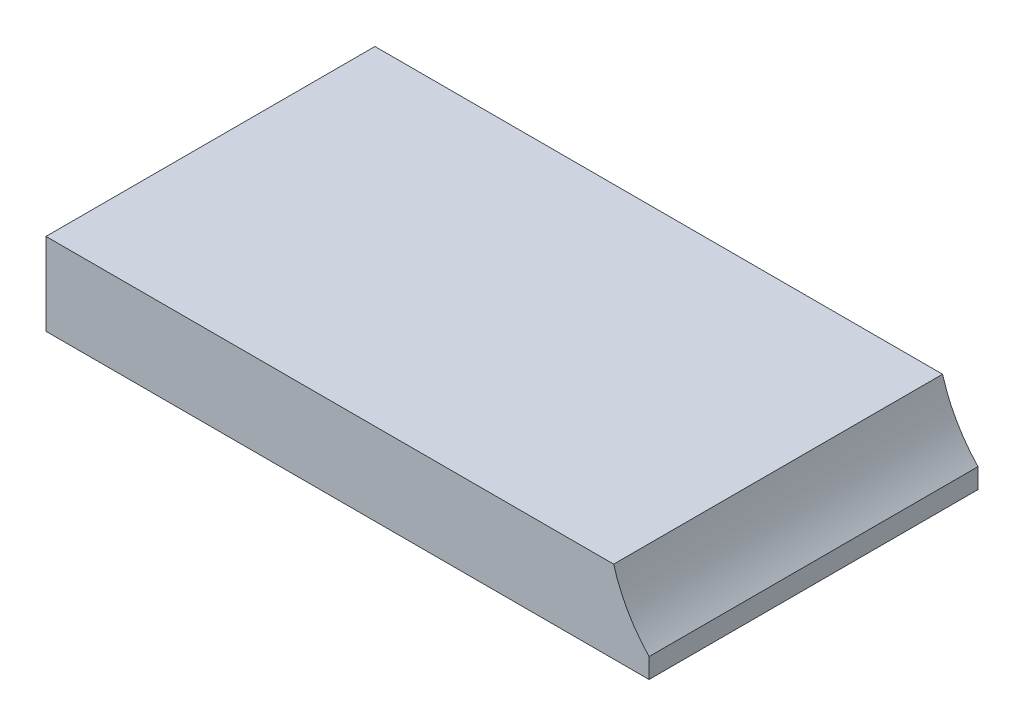
ISO-10303-21;
HEADER;
FILE_DESCRIPTION(('STEP AP214'),'2;1');
FILE_NAME('part.step','',(''),(''),'','','');
FILE_SCHEMA(('AUTOMOTIVE_DESIGN { 1 0 10303 214 1 1 1 1 }'));
ENDSEC;
DATA;
#1=APPLICATION_CONTEXT('core data for automotive mechanical design processes');
#2=APPLICATION_PROTOCOL_DEFINITION('international standard','automotive_design',2000,#1);
#3=PRODUCT_CONTEXT('',#1,'mechanical');
#4=PRODUCT('Part','Part','',(#3));
#5=PRODUCT_RELATED_PRODUCT_CATEGORY('part','',(#4));
#6=PRODUCT_DEFINITION_FORMATION('','',#4);
#7=PRODUCT_DEFINITION_CONTEXT('part definition',#1,'design');
#8=PRODUCT_DEFINITION('design','',#6,#7);
#9=PRODUCT_DEFINITION_SHAPE('','',#8);
#10=(LENGTH_UNIT() NAMED_UNIT(*) SI_UNIT(.MILLI.,.METRE.));
#11=(NAMED_UNIT(*) PLANE_ANGLE_UNIT() SI_UNIT($,.RADIAN.));
#12=(NAMED_UNIT(*) SI_UNIT($,.STERADIAN.) SOLID_ANGLE_UNIT());
#13=UNCERTAINTY_MEASURE_WITH_UNIT(LENGTH_MEASURE(1.E-05),#10,'distance_accuracy_value','');
#14=(GEOMETRIC_REPRESENTATION_CONTEXT(3) GLOBAL_UNCERTAINTY_ASSIGNED_CONTEXT((#13)) GLOBAL_UNIT_ASSIGNED_CONTEXT((#10,
#11,#12)) REPRESENTATION_CONTEXT('',''));
#15=CARTESIAN_POINT('',(0.,0.,0.));
#16=DIRECTION('',(0.,0.,1.));
#17=DIRECTION('',(1.,0.,0.));
#18=AXIS2_PLACEMENT_3D('',#15,#16,#17);
#19=CARTESIAN_POINT('',(0.,3.,0.));
#20=DIRECTION('',(1.,0.,0.));
#21=DIRECTION('',(0.,0.,-1.));
#22=AXIS2_PLACEMENT_3D('',#19,#20,#21);
#23=PLANE('',#22);
#24=DIRECTION('',(0.,0.,1.));
#25=VECTOR('',#24,1.);
#26=CARTESIAN_POINT('',(0.,0.,0.));
#27=LINE('',#26,#25);
#28=CARTESIAN_POINT('',(0.,0.,-12.));
#29=VERTEX_POINT('',#28);
#30=CARTESIAN_POINT('',(0.,0.,0.));
#31=VERTEX_POINT('',#30);
#32=EDGE_CURVE('E88',#29,#31,#27,.T.);
#33=ORIENTED_EDGE('',*,*,#32,.T.);
#34=DIRECTION('',(0.,-1.,0.));
#35=VECTOR('',#34,1.);
#36=CARTESIAN_POINT('',(0.,3.,0.));
#37=LINE('',#36,#35);
#38=CARTESIAN_POINT('',(0.,3.,0.));
#39=VERTEX_POINT('',#38);
#40=EDGE_CURVE('E38',#39,#31,#37,.T.);
#41=ORIENTED_EDGE('',*,*,#40,.F.);
#42=DIRECTION('',(0.,0.,1.));
#43=VECTOR('',#42,1.);
#44=CARTESIAN_POINT('',(0.,3.,0.));
#45=LINE('',#44,#43);
#46=CARTESIAN_POINT('',(0.,3.,-12.));
#47=VERTEX_POINT('',#46);
#48=EDGE_CURVE('E82',#47,#39,#45,.T.);
#49=ORIENTED_EDGE('',*,*,#48,.F.);
#50=DIRECTION('',(0.,-1.,0.));
#51=VECTOR('',#50,1.);
#52=CARTESIAN_POINT('',(0.,3.,-12.));
#53=LINE('',#52,#51);
#54=EDGE_CURVE('E74',#47,#29,#53,.T.);
#55=ORIENTED_EDGE('',*,*,#54,.T.);
#56=EDGE_LOOP('',(#33,#41,#49,#55));
#57=FACE_BOUND('',#56,.T.);
#58=ADVANCED_FACE('F31',(#57),#23,.F.);
#59=CARTESIAN_POINT('',(0.,3.,0.));
#60=DIRECTION('',(0.,0.,-1.));
#61=DIRECTION('',(-1.,0.,0.));
#62=AXIS2_PLACEMENT_3D('',#59,#60,#61);
#63=PLANE('',#62);
#64=DIRECTION('',(0.,-1.,0.));
#65=VECTOR('',#64,1.);
#66=CARTESIAN_POINT('',(22.,3.,0.));
#67=LINE('',#66,#65);
#68=CARTESIAN_POINT('',(22.,0.725082782364637,0.));
#69=VERTEX_POINT('',#68);
#70=CARTESIAN_POINT('',(22.,0.,0.));
#71=VERTEX_POINT('',#70);
#72=EDGE_CURVE('E104',#69,#71,#67,.T.);
#73=ORIENTED_EDGE('',*,*,#72,.F.);
#74=CARTESIAN_POINT('',(26.,4.5,0.));
#75=DIRECTION('',(0.,0.,1.));
#76=DIRECTION('',(1.,0.,0.));
#77=AXIS2_PLACEMENT_3D('',#74,#75,#76);
#78=CIRCLE('',#77,5.49999999999999);
#79=CARTESIAN_POINT('',(20.7084973778708,3.,0.));
#80=VERTEX_POINT('',#79);
#81=EDGE_CURVE('E113',#80,#69,#78,.T.);
#82=ORIENTED_EDGE('',*,*,#81,.F.);
#83=DIRECTION('',(1.,0.,0.));
#84=VECTOR('',#83,1.);
#85=CARTESIAN_POINT('',(0.,3.,0.));
#86=LINE('',#85,#84);
#87=EDGE_CURVE('E110',#39,#80,#86,.T.);
#88=ORIENTED_EDGE('',*,*,#87,.F.);
#89=ORIENTED_EDGE('',*,*,#40,.T.);
#90=DIRECTION('',(1.,0.,0.));
#91=VECTOR('',#90,1.);
#92=CARTESIAN_POINT('',(0.,0.,0.));
#93=LINE('',#92,#91);
#94=EDGE_CURVE('E92',#31,#71,#93,.T.);
#95=ORIENTED_EDGE('',*,*,#94,.T.);
#96=EDGE_LOOP('',(#73,#82,#88,#89,#95));
#97=FACE_BOUND('',#96,.T.);
#98=ADVANCED_FACE('F107',(#97),#63,.F.);
#99=CARTESIAN_POINT('',(22.,3.,0.));
#100=DIRECTION('',(-1.,0.,0.));
#101=DIRECTION('',(0.,0.,1.));
#102=AXIS2_PLACEMENT_3D('',#99,#100,#101);
#103=PLANE('',#102);
#104=DIRECTION('',(0.,-1.,0.));
#105=VECTOR('',#104,1.);
#106=CARTESIAN_POINT('',(22.,3.,-12.));
#107=LINE('',#106,#105);
#108=CARTESIAN_POINT('',(22.,0.725082782364637,-12.));
#109=VERTEX_POINT('',#108);
#110=CARTESIAN_POINT('',(22.,0.,-12.));
#111=VERTEX_POINT('',#110);
#112=EDGE_CURVE('E77',#109,#111,#107,.T.);
#113=ORIENTED_EDGE('',*,*,#112,.F.);
#114=DIRECTION('',(0.,0.,1.));
#115=VECTOR('',#114,1.);
#116=CARTESIAN_POINT('',(22.,0.725082782364637,-12.));
#117=LINE('',#116,#115);
#118=EDGE_CURVE('E94',#109,#69,#117,.T.);
#119=ORIENTED_EDGE('',*,*,#118,.T.);
#120=ORIENTED_EDGE('',*,*,#72,.T.);
#121=DIRECTION('',(0.,0.,-1.));
#122=VECTOR('',#121,1.);
#123=CARTESIAN_POINT('',(22.,0.,0.));
#124=LINE('',#123,#122);
#125=EDGE_CURVE('E83',#71,#111,#124,.T.);
#126=ORIENTED_EDGE('',*,*,#125,.T.);
#127=EDGE_LOOP('',(#113,#119,#120,#126));
#128=FACE_BOUND('',#127,.T.);
#129=ADVANCED_FACE('F120',(#128),#103,.F.);
#130=CARTESIAN_POINT('',(0.,3.,-12.));
#131=DIRECTION('',(0.,0.,1.));
#132=DIRECTION('',(1.,0.,0.));
#133=AXIS2_PLACEMENT_3D('',#130,#131,#132);
#134=PLANE('',#133);
#135=DIRECTION('',(-1.,0.,0.));
#136=VECTOR('',#135,1.);
#137=CARTESIAN_POINT('',(0.,3.,-12.));
#138=LINE('',#137,#136);
#139=CARTESIAN_POINT('',(20.7084973778708,3.,-12.));
#140=VERTEX_POINT('',#139);
#141=EDGE_CURVE('E52',#140,#47,#138,.T.);
#142=ORIENTED_EDGE('',*,*,#141,.F.);
#143=CARTESIAN_POINT('',(26.,4.5,-12.));
#144=DIRECTION('',(0.,0.,1.));
#145=DIRECTION('',(1.,0.,0.));
#146=AXIS2_PLACEMENT_3D('',#143,#144,#145);
#147=CIRCLE('',#146,5.49999999999999);
#148=EDGE_CURVE('E45',#140,#109,#147,.T.);
#149=ORIENTED_EDGE('',*,*,#148,.T.);
#150=ORIENTED_EDGE('',*,*,#112,.T.);
#151=DIRECTION('',(-1.,0.,0.));
#152=VECTOR('',#151,1.);
#153=CARTESIAN_POINT('',(0.,0.,-12.));
#154=LINE('',#153,#152);
#155=EDGE_CURVE('E71',#111,#29,#154,.T.);
#156=ORIENTED_EDGE('',*,*,#155,.T.);
#157=ORIENTED_EDGE('',*,*,#54,.F.);
#158=EDGE_LOOP('',(#142,#149,#150,#156,#157));
#159=FACE_BOUND('',#158,.T.);
#160=ADVANCED_FACE('F73',(#159),#134,.F.);
#161=CARTESIAN_POINT('',(0.,3.,-12.));
#162=DIRECTION('',(0.,-1.,0.));
#163=DIRECTION('',(0.,0.,-1.));
#164=AXIS2_PLACEMENT_3D('',#161,#162,#163);
#165=PLANE('',#164);
#166=ORIENTED_EDGE('',*,*,#87,.T.);
#167=DIRECTION('',(0.,0.,1.));
#168=VECTOR('',#167,1.);
#169=CARTESIAN_POINT('',(20.7084973778708,3.,-12.));
#170=LINE('',#169,#168);
#171=EDGE_CURVE('E11',#80,#140,#170,.F.);
#172=ORIENTED_EDGE('',*,*,#171,.T.);
#173=ORIENTED_EDGE('',*,*,#141,.T.);
#174=ORIENTED_EDGE('',*,*,#48,.T.);
#175=EDGE_LOOP('',(#166,#172,#173,#174));
#176=FACE_BOUND('',#175,.T.);
#177=ADVANCED_FACE('F114',(#176),#165,.F.);
#178=CARTESIAN_POINT('',(0.,0.,-12.));
#179=DIRECTION('',(0.,-1.,0.));
#180=DIRECTION('',(0.,0.,-1.));
#181=AXIS2_PLACEMENT_3D('',#178,#179,#180);
#182=PLANE('',#181);
#183=ORIENTED_EDGE('',*,*,#32,.F.);
#184=ORIENTED_EDGE('',*,*,#155,.F.);
#185=ORIENTED_EDGE('',*,*,#125,.F.);
#186=ORIENTED_EDGE('',*,*,#94,.F.);
#187=EDGE_LOOP('',(#183,#184,#185,#186));
#188=FACE_BOUND('',#187,.T.);
#189=ADVANCED_FACE('F90',(#188),#182,.T.);
#190=CARTESIAN_POINT('',(26.,4.5,-12.));
#191=DIRECTION('',(0.,0.,1.));
#192=DIRECTION('',(1.,0.,0.));
#193=AXIS2_PLACEMENT_3D('',#190,#191,#192);
#194=CYLINDRICAL_SURFACE('',#193,5.49999999999999);
#195=ORIENTED_EDGE('',*,*,#148,.F.);
#196=ORIENTED_EDGE('',*,*,#171,.F.);
#197=ORIENTED_EDGE('',*,*,#81,.T.);
#198=ORIENTED_EDGE('',*,*,#118,.F.);
#199=EDGE_LOOP('',(#195,#196,#197,#198));
#200=FACE_BOUND('',#199,.T.);
#201=ADVANCED_FACE('F123',(#200),#194,.F.);
#202=CLOSED_SHELL('',(#58,#98,#129,#160,#177,#189,#201));
#203=MANIFOLD_SOLID_BREP('B2',#202);
#204=ADVANCED_BREP_SHAPE_REPRESENTATION('',(#18,#203),#14);
#205=SHAPE_DEFINITION_REPRESENTATION(#9,#204);
ENDSEC;
END-ISO-10303-21;
